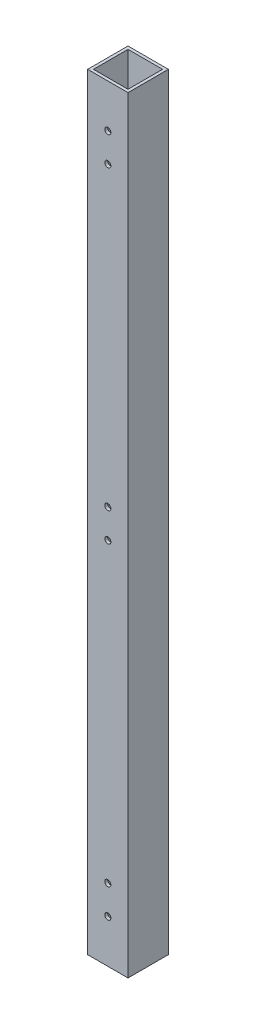
ISO-10303-21;
HEADER;
FILE_DESCRIPTION(('STEP AP214'),'2;1');
FILE_NAME('part.step','',(''),(''),'','','');
FILE_SCHEMA(('AUTOMOTIVE_DESIGN { 1 0 10303 214 1 1 1 1 }'));
ENDSEC;
DATA;
#1=APPLICATION_CONTEXT('core data for automotive mechanical design processes');
#2=APPLICATION_PROTOCOL_DEFINITION('international standard','automotive_design',2000,#1);
#3=PRODUCT_CONTEXT('',#1,'mechanical');
#4=PRODUCT('Part','Part','',(#3));
#5=PRODUCT_RELATED_PRODUCT_CATEGORY('part','',(#4));
#6=PRODUCT_DEFINITION_FORMATION('','',#4);
#7=PRODUCT_DEFINITION_CONTEXT('part definition',#1,'design');
#8=PRODUCT_DEFINITION('design','',#6,#7);
#9=PRODUCT_DEFINITION_SHAPE('','',#8);
#10=(LENGTH_UNIT() NAMED_UNIT(*) SI_UNIT(.MILLI.,.METRE.));
#11=(NAMED_UNIT(*) PLANE_ANGLE_UNIT() SI_UNIT($,.RADIAN.));
#12=(NAMED_UNIT(*) SI_UNIT($,.STERADIAN.) SOLID_ANGLE_UNIT());
#13=UNCERTAINTY_MEASURE_WITH_UNIT(LENGTH_MEASURE(1.E-05),#10,'distance_accuracy_value','');
#14=(GEOMETRIC_REPRESENTATION_CONTEXT(3) GLOBAL_UNCERTAINTY_ASSIGNED_CONTEXT((#13)) GLOBAL_UNIT_ASSIGNED_CONTEXT((#10,
#11,#12)) REPRESENTATION_CONTEXT('',''));
#15=CARTESIAN_POINT('',(0.,0.,0.));
#16=DIRECTION('',(0.,0.,1.));
#17=DIRECTION('',(1.,0.,0.));
#18=AXIS2_PLACEMENT_3D('',#15,#16,#17);
#19=CARTESIAN_POINT('',(0.,844.55,0.));
#20=DIRECTION('',(0.,-1.,0.));
#21=DIRECTION('',(0.,0.,-1.));
#22=AXIS2_PLACEMENT_3D('',#19,#20,#21);
#23=PLANE('',#22);
#24=DIRECTION('',(0.,0.,1.));
#25=VECTOR('',#24,1.);
#26=CARTESIAN_POINT('',(0.,844.55,0.));
#27=LINE('',#26,#25);
#28=CARTESIAN_POINT('',(0.,844.55,-44.45));
#29=VERTEX_POINT('',#28);
#30=CARTESIAN_POINT('',(0.,844.55,0.));
#31=VERTEX_POINT('',#30);
#32=EDGE_CURVE('E144',#29,#31,#27,.T.);
#33=ORIENTED_EDGE('',*,*,#32,.T.);
#34=DIRECTION('',(1.,0.,0.));
#35=VECTOR('',#34,1.);
#36=CARTESIAN_POINT('',(0.,844.55,0.));
#37=LINE('',#36,#35);
#38=CARTESIAN_POINT('',(44.45,844.55,0.));
#39=VERTEX_POINT('',#38);
#40=EDGE_CURVE('E147',#31,#39,#37,.T.);
#41=ORIENTED_EDGE('',*,*,#40,.T.);
#42=DIRECTION('',(0.,0.,-1.));
#43=VECTOR('',#42,1.);
#44=CARTESIAN_POINT('',(44.45,844.55,0.));
#45=LINE('',#44,#43);
#46=CARTESIAN_POINT('',(44.45,844.55,-44.45));
#47=VERTEX_POINT('',#46);
#48=EDGE_CURVE('E150',#39,#47,#45,.T.);
#49=ORIENTED_EDGE('',*,*,#48,.T.);
#50=DIRECTION('',(-1.,0.,0.));
#51=VECTOR('',#50,1.);
#52=CARTESIAN_POINT('',(0.,844.55,-44.45));
#53=LINE('',#52,#51);
#54=EDGE_CURVE('E152',#47,#29,#53,.T.);
#55=ORIENTED_EDGE('',*,*,#54,.T.);
#56=EDGE_LOOP('',(#33,#41,#49,#55));
#57=FACE_BOUND('',#56,.T.);
#58=DIRECTION('',(0.,0.,1.));
#59=VECTOR('',#58,1.);
#60=CARTESIAN_POINT('',(3.175,844.55,-41.275));
#61=LINE('',#60,#59);
#62=CARTESIAN_POINT('',(3.175,844.55,-41.275));
#63=VERTEX_POINT('',#62);
#64=CARTESIAN_POINT('',(3.17500000000001,844.55,-3.175));
#65=VERTEX_POINT('',#64);
#66=EDGE_CURVE('E106',#63,#65,#61,.T.);
#67=ORIENTED_EDGE('',*,*,#66,.F.);
#68=DIRECTION('',(-1.,0.,0.));
#69=VECTOR('',#68,1.);
#70=CARTESIAN_POINT('',(3.175,844.55,-41.275));
#71=LINE('',#70,#69);
#72=CARTESIAN_POINT('',(41.275,844.55,-41.275));
#73=VERTEX_POINT('',#72);
#74=EDGE_CURVE('E128',#73,#63,#71,.T.);
#75=ORIENTED_EDGE('',*,*,#74,.F.);
#76=DIRECTION('',(0.,0.,-1.));
#77=VECTOR('',#76,1.);
#78=CARTESIAN_POINT('',(41.275,844.55,-41.275));
#79=LINE('',#78,#77);
#80=CARTESIAN_POINT('',(41.275,844.55,-3.175));
#81=VERTEX_POINT('',#80);
#82=EDGE_CURVE('E126',#81,#73,#79,.T.);
#83=ORIENTED_EDGE('',*,*,#82,.F.);
#84=DIRECTION('',(1.,0.,0.));
#85=VECTOR('',#84,1.);
#86=CARTESIAN_POINT('',(3.17500000000001,844.55,-3.175));
#87=LINE('',#86,#85);
#88=EDGE_CURVE('E114',#65,#81,#87,.T.);
#89=ORIENTED_EDGE('',*,*,#88,.F.);
#90=EDGE_LOOP('',(#67,#75,#83,#89));
#91=FACE_BOUND('',#90,.T.);
#92=ADVANCED_FACE('F39',(#57,#91),#23,.F.);
#93=CARTESIAN_POINT('',(0.,0.,0.));
#94=DIRECTION('',(0.,-1.,0.));
#95=DIRECTION('',(0.,0.,-1.));
#96=AXIS2_PLACEMENT_3D('',#93,#94,#95);
#97=PLANE('',#96);
#98=DIRECTION('',(0.,0.,1.));
#99=VECTOR('',#98,1.);
#100=CARTESIAN_POINT('',(0.,0.,0.));
#101=LINE('',#100,#99);
#102=CARTESIAN_POINT('',(0.,0.,-44.45));
#103=VERTEX_POINT('',#102);
#104=CARTESIAN_POINT('',(0.,0.,0.));
#105=VERTEX_POINT('',#104);
#106=EDGE_CURVE('E122',#103,#105,#101,.T.);
#107=ORIENTED_EDGE('',*,*,#106,.F.);
#108=DIRECTION('',(-1.,0.,0.));
#109=VECTOR('',#108,1.);
#110=CARTESIAN_POINT('',(0.,0.,-44.45));
#111=LINE('',#110,#109);
#112=CARTESIAN_POINT('',(44.45,0.,-44.45));
#113=VERTEX_POINT('',#112);
#114=EDGE_CURVE('E148',#113,#103,#111,.T.);
#115=ORIENTED_EDGE('',*,*,#114,.F.);
#116=DIRECTION('',(0.,0.,-1.));
#117=VECTOR('',#116,1.);
#118=CARTESIAN_POINT('',(44.45,0.,0.));
#119=LINE('',#118,#117);
#120=CARTESIAN_POINT('',(44.45,0.,0.));
#121=VERTEX_POINT('',#120);
#122=EDGE_CURVE('E159',#121,#113,#119,.T.);
#123=ORIENTED_EDGE('',*,*,#122,.F.);
#124=DIRECTION('',(1.,0.,0.));
#125=VECTOR('',#124,1.);
#126=CARTESIAN_POINT('',(0.,0.,0.));
#127=LINE('',#126,#125);
#128=EDGE_CURVE('E157',#105,#121,#127,.T.);
#129=ORIENTED_EDGE('',*,*,#128,.F.);
#130=EDGE_LOOP('',(#107,#115,#123,#129));
#131=FACE_BOUND('',#130,.T.);
#132=DIRECTION('',(-1.,0.,0.));
#133=VECTOR('',#132,1.);
#134=CARTESIAN_POINT('',(3.175,0.,-41.275));
#135=LINE('',#134,#133);
#136=CARTESIAN_POINT('',(41.275,0.,-41.275));
#137=VERTEX_POINT('',#136);
#138=CARTESIAN_POINT('',(3.175,0.,-41.275));
#139=VERTEX_POINT('',#138);
#140=EDGE_CURVE('E115',#137,#139,#135,.T.);
#141=ORIENTED_EDGE('',*,*,#140,.T.);
#142=DIRECTION('',(0.,0.,1.));
#143=VECTOR('',#142,1.);
#144=CARTESIAN_POINT('',(3.175,0.,-41.275));
#145=LINE('',#144,#143);
#146=CARTESIAN_POINT('',(3.17500000000001,0.,-3.175));
#147=VERTEX_POINT('',#146);
#148=EDGE_CURVE('E64',#139,#147,#145,.T.);
#149=ORIENTED_EDGE('',*,*,#148,.T.);
#150=DIRECTION('',(1.,0.,0.));
#151=VECTOR('',#150,1.);
#152=CARTESIAN_POINT('',(3.17500000000001,0.,-3.175));
#153=LINE('',#152,#151);
#154=CARTESIAN_POINT('',(41.275,0.,-3.175));
#155=VERTEX_POINT('',#154);
#156=EDGE_CURVE('E121',#147,#155,#153,.T.);
#157=ORIENTED_EDGE('',*,*,#156,.T.);
#158=DIRECTION('',(0.,0.,-1.));
#159=VECTOR('',#158,1.);
#160=CARTESIAN_POINT('',(41.275,0.,-41.275));
#161=LINE('',#160,#159);
#162=EDGE_CURVE('E136',#155,#137,#161,.T.);
#163=ORIENTED_EDGE('',*,*,#162,.T.);
#164=EDGE_LOOP('',(#141,#149,#157,#163));
#165=FACE_BOUND('',#164,.T.);
#166=ADVANCED_FACE('F243',(#131,#165),#97,.T.);
#167=CARTESIAN_POINT('',(0.,844.55,0.));
#168=DIRECTION('',(1.,0.,0.));
#169=DIRECTION('',(0.,0.,-1.));
#170=AXIS2_PLACEMENT_3D('',#167,#168,#169);
#171=PLANE('',#170);
#172=ORIENTED_EDGE('',*,*,#106,.T.);
#173=DIRECTION('',(0.,-1.,0.));
#174=VECTOR('',#173,1.);
#175=CARTESIAN_POINT('',(0.,844.55,0.));
#176=LINE('',#175,#174);
#177=EDGE_CURVE('E11',#31,#105,#176,.T.);
#178=ORIENTED_EDGE('',*,*,#177,.F.);
#179=ORIENTED_EDGE('',*,*,#32,.F.);
#180=DIRECTION('',(0.,-1.,0.));
#181=VECTOR('',#180,1.);
#182=CARTESIAN_POINT('',(0.,844.55,-44.45));
#183=LINE('',#182,#181);
#184=EDGE_CURVE('E154',#29,#103,#183,.T.);
#185=ORIENTED_EDGE('',*,*,#184,.T.);
#186=EDGE_LOOP('',(#172,#178,#179,#185));
#187=FACE_BOUND('',#186,.T.);
#188=ADVANCED_FACE('F41',(#187),#171,.F.);
#189=CARTESIAN_POINT('',(0.,844.55,0.));
#190=DIRECTION('',(0.,0.,-1.));
#191=DIRECTION('',(-1.,0.,0.));
#192=AXIS2_PLACEMENT_3D('',#189,#190,#191);
#193=PLANE('',#192);
#194=CARTESIAN_POINT('',(22.225,796.925,0.));
#195=DIRECTION('',(0.,0.,1.));
#196=DIRECTION('',(1.,0.,0.));
#197=AXIS2_PLACEMENT_3D('',#194,#195,#196);
#198=CIRCLE('',#197,3.37350099999999);
#199=CARTESIAN_POINT('',(25.598501,796.925,0.));
#200=VERTEX_POINT('',#199);
#201=EDGE_CURVE('E280',#200,#200,#198,.T.);
#202=ORIENTED_EDGE('',*,*,#201,.F.);
#203=EDGE_LOOP('',(#202));
#204=FACE_BOUND('',#203,.T.);
#205=CARTESIAN_POINT('',(22.225,765.175,0.));
#206=DIRECTION('',(0.,0.,1.));
#207=DIRECTION('',(1.,0.,0.));
#208=AXIS2_PLACEMENT_3D('',#205,#206,#207);
#209=CIRCLE('',#208,3.37350099999999);
#210=CARTESIAN_POINT('',(25.598501,765.175,0.));
#211=VERTEX_POINT('',#210);
#212=EDGE_CURVE('E193',#211,#211,#209,.T.);
#213=ORIENTED_EDGE('',*,*,#212,.F.);
#214=EDGE_LOOP('',(#213));
#215=FACE_BOUND('',#214,.T.);
#216=CARTESIAN_POINT('',(22.225,438.15,0.));
#217=DIRECTION('',(0.,0.,1.));
#218=DIRECTION('',(1.,0.,0.));
#219=AXIS2_PLACEMENT_3D('',#216,#217,#218);
#220=CIRCLE('',#219,3.37350099999999);
#221=CARTESIAN_POINT('',(25.598501,438.15,0.));
#222=VERTEX_POINT('',#221);
#223=EDGE_CURVE('E190',#222,#222,#220,.T.);
#224=ORIENTED_EDGE('',*,*,#223,.F.);
#225=EDGE_LOOP('',(#224));
#226=FACE_BOUND('',#225,.T.);
#227=CARTESIAN_POINT('',(22.225,406.4,0.));
#228=DIRECTION('',(0.,0.,1.));
#229=DIRECTION('',(1.,0.,0.));
#230=AXIS2_PLACEMENT_3D('',#227,#228,#229);
#231=CIRCLE('',#230,3.37350099999999);
#232=CARTESIAN_POINT('',(25.598501,406.4,0.));
#233=VERTEX_POINT('',#232);
#234=EDGE_CURVE('E208',#233,#233,#231,.T.);
#235=ORIENTED_EDGE('',*,*,#234,.F.);
#236=EDGE_LOOP('',(#235));
#237=FACE_BOUND('',#236,.T.);
#238=CARTESIAN_POINT('',(22.225,79.3750000000001,0.));
#239=DIRECTION('',(0.,0.,1.));
#240=DIRECTION('',(1.,0.,0.));
#241=AXIS2_PLACEMENT_3D('',#238,#239,#240);
#242=CIRCLE('',#241,3.37350099999999);
#243=CARTESIAN_POINT('',(25.598501,79.3750000000001,0.));
#244=VERTEX_POINT('',#243);
#245=EDGE_CURVE('E215',#244,#244,#242,.T.);
#246=ORIENTED_EDGE('',*,*,#245,.F.);
#247=EDGE_LOOP('',(#246));
#248=FACE_BOUND('',#247,.T.);
#249=CARTESIAN_POINT('',(22.225,47.625,0.));
#250=DIRECTION('',(0.,0.,1.));
#251=DIRECTION('',(1.,0.,0.));
#252=AXIS2_PLACEMENT_3D('',#249,#250,#251);
#253=CIRCLE('',#252,3.37350099999999);
#254=CARTESIAN_POINT('',(25.598501,47.625,0.));
#255=VERTEX_POINT('',#254);
#256=EDGE_CURVE('E222',#255,#255,#253,.T.);
#257=ORIENTED_EDGE('',*,*,#256,.F.);
#258=EDGE_LOOP('',(#257));
#259=FACE_BOUND('',#258,.T.);
#260=ORIENTED_EDGE('',*,*,#128,.T.);
#261=DIRECTION('',(0.,-1.,0.));
#262=VECTOR('',#261,1.);
#263=CARTESIAN_POINT('',(44.45,844.55,0.));
#264=LINE('',#263,#262);
#265=EDGE_CURVE('E48',#39,#121,#264,.T.);
#266=ORIENTED_EDGE('',*,*,#265,.F.);
#267=ORIENTED_EDGE('',*,*,#40,.F.);
#268=ORIENTED_EDGE('',*,*,#177,.T.);
#269=EDGE_LOOP('',(#260,#266,#267,#268));
#270=FACE_BOUND('',#269,.T.);
#271=ADVANCED_FACE('F270',(#204,#215,#226,#237,#248,#259,#270),#193,.F.);
#272=CARTESIAN_POINT('',(44.45,844.55,0.));
#273=DIRECTION('',(-1.,0.,0.));
#274=DIRECTION('',(0.,0.,1.));
#275=AXIS2_PLACEMENT_3D('',#272,#273,#274);
#276=PLANE('',#275);
#277=ORIENTED_EDGE('',*,*,#122,.T.);
#278=DIRECTION('',(0.,-1.,0.));
#279=VECTOR('',#278,1.);
#280=CARTESIAN_POINT('',(44.45,844.55,-44.45));
#281=LINE('',#280,#279);
#282=EDGE_CURVE('E164',#47,#113,#281,.T.);
#283=ORIENTED_EDGE('',*,*,#282,.F.);
#284=ORIENTED_EDGE('',*,*,#48,.F.);
#285=ORIENTED_EDGE('',*,*,#265,.T.);
#286=EDGE_LOOP('',(#277,#283,#284,#285));
#287=FACE_BOUND('',#286,.T.);
#288=ADVANCED_FACE('F267',(#287),#276,.F.);
#289=CARTESIAN_POINT('',(0.,844.55,-44.45));
#290=DIRECTION('',(0.,0.,1.));
#291=DIRECTION('',(1.,0.,0.));
#292=AXIS2_PLACEMENT_3D('',#289,#290,#291);
#293=PLANE('',#292);
#294=CARTESIAN_POINT('',(22.225,796.925,-44.45));
#295=DIRECTION('',(0.,0.,1.));
#296=DIRECTION('',(1.,0.,0.));
#297=AXIS2_PLACEMENT_3D('',#294,#295,#296);
#298=CIRCLE('',#297,3.37350099999999);
#299=CARTESIAN_POINT('',(25.598501,796.925,-44.45));
#300=VERTEX_POINT('',#299);
#301=EDGE_CURVE('E345',#300,#300,#298,.T.);
#302=ORIENTED_EDGE('',*,*,#301,.T.);
#303=EDGE_LOOP('',(#302));
#304=FACE_BOUND('',#303,.T.);
#305=CARTESIAN_POINT('',(22.225,765.175,-44.45));
#306=DIRECTION('',(0.,0.,1.));
#307=DIRECTION('',(1.,0.,0.));
#308=AXIS2_PLACEMENT_3D('',#305,#306,#307);
#309=CIRCLE('',#308,3.37350099999999);
#310=CARTESIAN_POINT('',(25.598501,765.175,-44.45));
#311=VERTEX_POINT('',#310);
#312=EDGE_CURVE('E186',#311,#311,#309,.T.);
#313=ORIENTED_EDGE('',*,*,#312,.T.);
#314=EDGE_LOOP('',(#313));
#315=FACE_BOUND('',#314,.T.);
#316=CARTESIAN_POINT('',(22.225,438.15,-44.45));
#317=DIRECTION('',(0.,0.,1.));
#318=DIRECTION('',(1.,0.,0.));
#319=AXIS2_PLACEMENT_3D('',#316,#317,#318);
#320=CIRCLE('',#319,3.37350099999999);
#321=CARTESIAN_POINT('',(25.598501,438.15,-44.45));
#322=VERTEX_POINT('',#321);
#323=EDGE_CURVE('E182',#322,#322,#320,.T.);
#324=ORIENTED_EDGE('',*,*,#323,.T.);
#325=EDGE_LOOP('',(#324));
#326=FACE_BOUND('',#325,.T.);
#327=CARTESIAN_POINT('',(22.225,406.4,-44.45));
#328=DIRECTION('',(0.,0.,1.));
#329=DIRECTION('',(1.,0.,0.));
#330=AXIS2_PLACEMENT_3D('',#327,#328,#329);
#331=CIRCLE('',#330,3.37350099999999);
#332=CARTESIAN_POINT('',(25.598501,406.4,-44.45));
#333=VERTEX_POINT('',#332);
#334=EDGE_CURVE('E178',#333,#333,#331,.T.);
#335=ORIENTED_EDGE('',*,*,#334,.T.);
#336=EDGE_LOOP('',(#335));
#337=FACE_BOUND('',#336,.T.);
#338=CARTESIAN_POINT('',(22.225,79.3750000000001,-44.45));
#339=DIRECTION('',(0.,0.,1.));
#340=DIRECTION('',(1.,0.,0.));
#341=AXIS2_PLACEMENT_3D('',#338,#339,#340);
#342=CIRCLE('',#341,3.37350099999999);
#343=CARTESIAN_POINT('',(25.598501,79.3750000000001,-44.45));
#344=VERTEX_POINT('',#343);
#345=EDGE_CURVE('E173',#344,#344,#342,.T.);
#346=ORIENTED_EDGE('',*,*,#345,.T.);
#347=EDGE_LOOP('',(#346));
#348=FACE_BOUND('',#347,.T.);
#349=CARTESIAN_POINT('',(22.225,47.625,-44.45));
#350=DIRECTION('',(0.,0.,1.));
#351=DIRECTION('',(1.,0.,0.));
#352=AXIS2_PLACEMENT_3D('',#349,#350,#351);
#353=CIRCLE('',#352,3.37350099999999);
#354=CARTESIAN_POINT('',(25.598501,47.625,-44.45));
#355=VERTEX_POINT('',#354);
#356=EDGE_CURVE('E225',#355,#355,#353,.T.);
#357=ORIENTED_EDGE('',*,*,#356,.T.);
#358=EDGE_LOOP('',(#357));
#359=FACE_BOUND('',#358,.T.);
#360=ORIENTED_EDGE('',*,*,#114,.T.);
#361=ORIENTED_EDGE('',*,*,#184,.F.);
#362=ORIENTED_EDGE('',*,*,#54,.F.);
#363=ORIENTED_EDGE('',*,*,#282,.T.);
#364=EDGE_LOOP('',(#360,#361,#362,#363));
#365=FACE_BOUND('',#364,.T.);
#366=ADVANCED_FACE('F264',(#304,#315,#326,#337,#348,#359,#365),#293,.F.);
#367=CARTESIAN_POINT('',(3.175,844.55,-41.275));
#368=DIRECTION('',(1.,0.,0.));
#369=DIRECTION('',(0.,0.,-1.));
#370=AXIS2_PLACEMENT_3D('',#367,#368,#369);
#371=PLANE('',#370);
#372=ORIENTED_EDGE('',*,*,#148,.F.);
#373=DIRECTION('',(0.,-1.,0.));
#374=VECTOR('',#373,1.);
#375=CARTESIAN_POINT('',(3.175,844.55,-41.275));
#376=LINE('',#375,#374);
#377=EDGE_CURVE('E110',#63,#139,#376,.T.);
#378=ORIENTED_EDGE('',*,*,#377,.F.);
#379=ORIENTED_EDGE('',*,*,#66,.T.);
#380=DIRECTION('',(0.,-1.,0.));
#381=VECTOR('',#380,1.);
#382=CARTESIAN_POINT('',(3.17500000000001,844.55,-3.175));
#383=LINE('',#382,#381);
#384=EDGE_CURVE('E109',#65,#147,#383,.T.);
#385=ORIENTED_EDGE('',*,*,#384,.T.);
#386=EDGE_LOOP('',(#372,#378,#379,#385));
#387=FACE_BOUND('',#386,.T.);
#388=ADVANCED_FACE('F108',(#387),#371,.T.);
#389=CARTESIAN_POINT('',(3.17500000000001,844.55,-3.175));
#390=DIRECTION('',(0.,0.,-1.));
#391=DIRECTION('',(-1.,0.,0.));
#392=AXIS2_PLACEMENT_3D('',#389,#390,#391);
#393=PLANE('',#392);
#394=CARTESIAN_POINT('',(22.225,796.925,-3.175));
#395=DIRECTION('',(0.,0.,-1.));
#396=DIRECTION('',(-1.,0.,0.));
#397=AXIS2_PLACEMENT_3D('',#394,#395,#396);
#398=CIRCLE('',#397,3.37350099999999);
#399=CARTESIAN_POINT('',(18.851499,796.925,-3.175));
#400=VERTEX_POINT('',#399);
#401=EDGE_CURVE('E198',#400,#400,#398,.T.);
#402=ORIENTED_EDGE('',*,*,#401,.F.);
#403=EDGE_LOOP('',(#402));
#404=FACE_BOUND('',#403,.T.);
#405=CARTESIAN_POINT('',(22.225,765.175,-3.175));
#406=DIRECTION('',(0.,0.,-1.));
#407=DIRECTION('',(-1.,0.,0.));
#408=AXIS2_PLACEMENT_3D('',#405,#406,#407);
#409=CIRCLE('',#408,3.37350099999999);
#410=CARTESIAN_POINT('',(18.851499,765.175,-3.175));
#411=VERTEX_POINT('',#410);
#412=EDGE_CURVE('E185',#411,#411,#409,.T.);
#413=ORIENTED_EDGE('',*,*,#412,.F.);
#414=EDGE_LOOP('',(#413));
#415=FACE_BOUND('',#414,.T.);
#416=CARTESIAN_POINT('',(22.225,438.15,-3.175));
#417=DIRECTION('',(0.,0.,-1.));
#418=DIRECTION('',(-1.,0.,0.));
#419=AXIS2_PLACEMENT_3D('',#416,#417,#418);
#420=CIRCLE('',#419,3.37350099999999);
#421=CARTESIAN_POINT('',(18.851499,438.15,-3.175));
#422=VERTEX_POINT('',#421);
#423=EDGE_CURVE('E179',#422,#422,#420,.T.);
#424=ORIENTED_EDGE('',*,*,#423,.F.);
#425=EDGE_LOOP('',(#424));
#426=FACE_BOUND('',#425,.T.);
#427=CARTESIAN_POINT('',(22.225,406.4,-3.175));
#428=DIRECTION('',(0.,0.,-1.));
#429=DIRECTION('',(-1.,0.,0.));
#430=AXIS2_PLACEMENT_3D('',#427,#428,#429);
#431=CIRCLE('',#430,3.37350099999999);
#432=CARTESIAN_POINT('',(18.851499,406.4,-3.175));
#433=VERTEX_POINT('',#432);
#434=EDGE_CURVE('E174',#433,#433,#431,.T.);
#435=ORIENTED_EDGE('',*,*,#434,.F.);
#436=EDGE_LOOP('',(#435));
#437=FACE_BOUND('',#436,.T.);
#438=CARTESIAN_POINT('',(22.225,79.3750000000001,-3.175));
#439=DIRECTION('',(0.,0.,-1.));
#440=DIRECTION('',(-1.,0.,0.));
#441=AXIS2_PLACEMENT_3D('',#438,#439,#440);
#442=CIRCLE('',#441,3.37350099999999);
#443=CARTESIAN_POINT('',(18.851499,79.3750000000001,-3.175));
#444=VERTEX_POINT('',#443);
#445=EDGE_CURVE('E169',#444,#444,#442,.T.);
#446=ORIENTED_EDGE('',*,*,#445,.F.);
#447=EDGE_LOOP('',(#446));
#448=FACE_BOUND('',#447,.T.);
#449=CARTESIAN_POINT('',(22.225,47.625,-3.175));
#450=DIRECTION('',(0.,0.,-1.));
#451=DIRECTION('',(-1.,0.,0.));
#452=AXIS2_PLACEMENT_3D('',#449,#450,#451);
#453=CIRCLE('',#452,3.37350099999999);
#454=CARTESIAN_POINT('',(18.851499,47.625,-3.175));
#455=VERTEX_POINT('',#454);
#456=EDGE_CURVE('E228',#455,#455,#453,.T.);
#457=ORIENTED_EDGE('',*,*,#456,.F.);
#458=EDGE_LOOP('',(#457));
#459=FACE_BOUND('',#458,.T.);
#460=ORIENTED_EDGE('',*,*,#156,.F.);
#461=ORIENTED_EDGE('',*,*,#384,.F.);
#462=ORIENTED_EDGE('',*,*,#88,.T.);
#463=DIRECTION('',(0.,-1.,0.));
#464=VECTOR('',#463,1.);
#465=CARTESIAN_POINT('',(41.275,844.55,-3.175));
#466=LINE('',#465,#464);
#467=EDGE_CURVE('E123',#81,#155,#466,.T.);
#468=ORIENTED_EDGE('',*,*,#467,.T.);
#469=EDGE_LOOP('',(#460,#461,#462,#468));
#470=FACE_BOUND('',#469,.T.);
#471=ADVANCED_FACE('F118',(#404,#415,#426,#437,#448,#459,#470),#393,.T.);
#472=CARTESIAN_POINT('',(41.275,844.55,-41.275));
#473=DIRECTION('',(-1.,0.,0.));
#474=DIRECTION('',(0.,0.,1.));
#475=AXIS2_PLACEMENT_3D('',#472,#473,#474);
#476=PLANE('',#475);
#477=ORIENTED_EDGE('',*,*,#162,.F.);
#478=ORIENTED_EDGE('',*,*,#467,.F.);
#479=ORIENTED_EDGE('',*,*,#82,.T.);
#480=DIRECTION('',(0.,-1.,0.));
#481=VECTOR('',#480,1.);
#482=CARTESIAN_POINT('',(41.275,844.55,-41.275));
#483=LINE('',#482,#481);
#484=EDGE_CURVE('E56',#73,#137,#483,.T.);
#485=ORIENTED_EDGE('',*,*,#484,.T.);
#486=EDGE_LOOP('',(#477,#478,#479,#485));
#487=FACE_BOUND('',#486,.T.);
#488=ADVANCED_FACE('F238',(#487),#476,.T.);
#489=CARTESIAN_POINT('',(3.175,844.55,-41.275));
#490=DIRECTION('',(0.,0.,1.));
#491=DIRECTION('',(1.,0.,0.));
#492=AXIS2_PLACEMENT_3D('',#489,#490,#491);
#493=PLANE('',#492);
#494=CARTESIAN_POINT('',(22.225,796.925,-41.275));
#495=DIRECTION('',(0.,0.,1.));
#496=DIRECTION('',(1.,0.,0.));
#497=AXIS2_PLACEMENT_3D('',#494,#495,#496);
#498=CIRCLE('',#497,3.37350099999999);
#499=CARTESIAN_POINT('',(25.598501,796.925,-41.275));
#500=VERTEX_POINT('',#499);
#501=EDGE_CURVE('E43',#500,#500,#498,.T.);
#502=ORIENTED_EDGE('',*,*,#501,.F.);
#503=EDGE_LOOP('',(#502));
#504=FACE_BOUND('',#503,.T.);
#505=CARTESIAN_POINT('',(22.225,765.175,-41.275));
#506=DIRECTION('',(0.,0.,1.));
#507=DIRECTION('',(1.,0.,0.));
#508=AXIS2_PLACEMENT_3D('',#505,#506,#507);
#509=CIRCLE('',#508,3.37350099999999);
#510=CARTESIAN_POINT('',(25.598501,765.175,-41.275));
#511=VERTEX_POINT('',#510);
#512=EDGE_CURVE('E183',#511,#511,#509,.T.);
#513=ORIENTED_EDGE('',*,*,#512,.F.);
#514=EDGE_LOOP('',(#513));
#515=FACE_BOUND('',#514,.T.);
#516=CARTESIAN_POINT('',(22.225,438.15,-41.275));
#517=DIRECTION('',(0.,0.,1.));
#518=DIRECTION('',(1.,0.,0.));
#519=AXIS2_PLACEMENT_3D('',#516,#517,#518);
#520=CIRCLE('',#519,3.37350099999999);
#521=CARTESIAN_POINT('',(25.598501,438.15,-41.275));
#522=VERTEX_POINT('',#521);
#523=EDGE_CURVE('E181',#522,#522,#520,.T.);
#524=ORIENTED_EDGE('',*,*,#523,.F.);
#525=EDGE_LOOP('',(#524));
#526=FACE_BOUND('',#525,.T.);
#527=CARTESIAN_POINT('',(22.225,406.4,-41.275));
#528=DIRECTION('',(0.,0.,1.));
#529=DIRECTION('',(1.,0.,0.));
#530=AXIS2_PLACEMENT_3D('',#527,#528,#529);
#531=CIRCLE('',#530,3.37350099999999);
#532=CARTESIAN_POINT('',(25.598501,406.4,-41.275));
#533=VERTEX_POINT('',#532);
#534=EDGE_CURVE('E177',#533,#533,#531,.T.);
#535=ORIENTED_EDGE('',*,*,#534,.F.);
#536=EDGE_LOOP('',(#535));
#537=FACE_BOUND('',#536,.T.);
#538=CARTESIAN_POINT('',(22.225,79.3750000000001,-41.275));
#539=DIRECTION('',(0.,0.,1.));
#540=DIRECTION('',(1.,0.,0.));
#541=AXIS2_PLACEMENT_3D('',#538,#539,#540);
#542=CIRCLE('',#541,3.37350099999999);
#543=CARTESIAN_POINT('',(25.598501,79.3750000000001,-41.275));
#544=VERTEX_POINT('',#543);
#545=EDGE_CURVE('E172',#544,#544,#542,.T.);
#546=ORIENTED_EDGE('',*,*,#545,.F.);
#547=EDGE_LOOP('',(#546));
#548=FACE_BOUND('',#547,.T.);
#549=CARTESIAN_POINT('',(22.225,47.625,-41.275));
#550=DIRECTION('',(0.,0.,1.));
#551=DIRECTION('',(1.,0.,0.));
#552=AXIS2_PLACEMENT_3D('',#549,#550,#551);
#553=CIRCLE('',#552,3.37350099999999);
#554=CARTESIAN_POINT('',(25.598501,47.625,-41.275));
#555=VERTEX_POINT('',#554);
#556=EDGE_CURVE('E134',#555,#555,#553,.T.);
#557=ORIENTED_EDGE('',*,*,#556,.F.);
#558=EDGE_LOOP('',(#557));
#559=FACE_BOUND('',#558,.T.);
#560=ORIENTED_EDGE('',*,*,#140,.F.);
#561=ORIENTED_EDGE('',*,*,#484,.F.);
#562=ORIENTED_EDGE('',*,*,#74,.T.);
#563=ORIENTED_EDGE('',*,*,#377,.T.);
#564=EDGE_LOOP('',(#560,#561,#562,#563));
#565=FACE_BOUND('',#564,.T.);
#566=ADVANCED_FACE('F236',(#504,#515,#526,#537,#548,#559,#565),#493,.T.);
#567=CARTESIAN_POINT('',(22.225,47.625,0.));
#568=DIRECTION('',(0.,0.,1.));
#569=DIRECTION('',(1.,0.,0.));
#570=AXIS2_PLACEMENT_3D('',#567,#568,#569);
#571=CYLINDRICAL_SURFACE('',#570,3.37350099999999);
#572=ORIENTED_EDGE('',*,*,#556,.T.);
#573=EDGE_LOOP('',(#572));
#574=FACE_BOUND('',#573,.T.);
#575=ORIENTED_EDGE('',*,*,#356,.F.);
#576=EDGE_LOOP('',(#575));
#577=FACE_BOUND('',#576,.T.);
#578=ADVANCED_FACE('F233',(#574,#577),#571,.F.);
#579=ORIENTED_EDGE('',*,*,#456,.T.);
#580=EDGE_LOOP('',(#579));
#581=FACE_BOUND('',#580,.T.);
#582=ORIENTED_EDGE('',*,*,#256,.T.);
#583=EDGE_LOOP('',(#582));
#584=FACE_BOUND('',#583,.T.);
#585=ADVANCED_FACE('F303',(#581,#584),#571,.F.);
#586=CARTESIAN_POINT('',(22.225,79.3750000000001,0.));
#587=DIRECTION('',(0.,0.,1.));
#588=DIRECTION('',(1.,0.,0.));
#589=AXIS2_PLACEMENT_3D('',#586,#587,#588);
#590=CYLINDRICAL_SURFACE('',#589,3.37350099999999);
#591=ORIENTED_EDGE('',*,*,#445,.T.);
#592=EDGE_LOOP('',(#591));
#593=FACE_BOUND('',#592,.T.);
#594=ORIENTED_EDGE('',*,*,#245,.T.);
#595=EDGE_LOOP('',(#594));
#596=FACE_BOUND('',#595,.T.);
#597=ADVANCED_FACE('F305',(#593,#596),#590,.F.);
#598=ORIENTED_EDGE('',*,*,#545,.T.);
#599=EDGE_LOOP('',(#598));
#600=FACE_BOUND('',#599,.T.);
#601=ORIENTED_EDGE('',*,*,#345,.F.);
#602=EDGE_LOOP('',(#601));
#603=FACE_BOUND('',#602,.T.);
#604=ADVANCED_FACE('F312',(#600,#603),#590,.F.);
#605=CARTESIAN_POINT('',(22.225,406.4,0.));
#606=DIRECTION('',(0.,0.,1.));
#607=DIRECTION('',(1.,0.,0.));
#608=AXIS2_PLACEMENT_3D('',#605,#606,#607);
#609=CYLINDRICAL_SURFACE('',#608,3.37350099999999);
#610=ORIENTED_EDGE('',*,*,#434,.T.);
#611=EDGE_LOOP('',(#610));
#612=FACE_BOUND('',#611,.T.);
#613=ORIENTED_EDGE('',*,*,#234,.T.);
#614=EDGE_LOOP('',(#613));
#615=FACE_BOUND('',#614,.T.);
#616=ADVANCED_FACE('F316',(#612,#615),#609,.F.);
#617=ORIENTED_EDGE('',*,*,#534,.T.);
#618=EDGE_LOOP('',(#617));
#619=FACE_BOUND('',#618,.T.);
#620=ORIENTED_EDGE('',*,*,#334,.F.);
#621=EDGE_LOOP('',(#620));
#622=FACE_BOUND('',#621,.T.);
#623=ADVANCED_FACE('F319',(#619,#622),#609,.F.);
#624=CARTESIAN_POINT('',(22.225,438.15,0.));
#625=DIRECTION('',(0.,0.,1.));
#626=DIRECTION('',(1.,0.,0.));
#627=AXIS2_PLACEMENT_3D('',#624,#625,#626);
#628=CYLINDRICAL_SURFACE('',#627,3.37350099999999);
#629=ORIENTED_EDGE('',*,*,#423,.T.);
#630=EDGE_LOOP('',(#629));
#631=FACE_BOUND('',#630,.T.);
#632=ORIENTED_EDGE('',*,*,#223,.T.);
#633=EDGE_LOOP('',(#632));
#634=FACE_BOUND('',#633,.T.);
#635=ADVANCED_FACE('F321',(#631,#634),#628,.F.);
#636=ORIENTED_EDGE('',*,*,#523,.T.);
#637=EDGE_LOOP('',(#636));
#638=FACE_BOUND('',#637,.T.);
#639=ORIENTED_EDGE('',*,*,#323,.F.);
#640=EDGE_LOOP('',(#639));
#641=FACE_BOUND('',#640,.T.);
#642=ADVANCED_FACE('F324',(#638,#641),#628,.F.);
#643=CARTESIAN_POINT('',(22.225,765.175,0.));
#644=DIRECTION('',(0.,0.,1.));
#645=DIRECTION('',(1.,0.,0.));
#646=AXIS2_PLACEMENT_3D('',#643,#644,#645);
#647=CYLINDRICAL_SURFACE('',#646,3.37350099999999);
#648=ORIENTED_EDGE('',*,*,#512,.T.);
#649=EDGE_LOOP('',(#648));
#650=FACE_BOUND('',#649,.T.);
#651=ORIENTED_EDGE('',*,*,#312,.F.);
#652=EDGE_LOOP('',(#651));
#653=FACE_BOUND('',#652,.T.);
#654=ADVANCED_FACE('F326',(#650,#653),#647,.F.);
#655=ORIENTED_EDGE('',*,*,#412,.T.);
#656=EDGE_LOOP('',(#655));
#657=FACE_BOUND('',#656,.T.);
#658=ORIENTED_EDGE('',*,*,#212,.T.);
#659=EDGE_LOOP('',(#658));
#660=FACE_BOUND('',#659,.T.);
#661=ADVANCED_FACE('F329',(#657,#660),#647,.F.);
#662=CARTESIAN_POINT('',(22.225,796.925,0.));
#663=DIRECTION('',(0.,0.,1.));
#664=DIRECTION('',(1.,0.,0.));
#665=AXIS2_PLACEMENT_3D('',#662,#663,#664);
#666=CYLINDRICAL_SURFACE('',#665,3.37350099999999);
#667=ORIENTED_EDGE('',*,*,#501,.T.);
#668=EDGE_LOOP('',(#667));
#669=FACE_BOUND('',#668,.T.);
#670=ORIENTED_EDGE('',*,*,#301,.F.);
#671=EDGE_LOOP('',(#670));
#672=FACE_BOUND('',#671,.T.);
#673=ADVANCED_FACE('F330',(#669,#672),#666,.F.);
#674=ORIENTED_EDGE('',*,*,#401,.T.);
#675=EDGE_LOOP('',(#674));
#676=FACE_BOUND('',#675,.T.);
#677=ORIENTED_EDGE('',*,*,#201,.T.);
#678=EDGE_LOOP('',(#677));
#679=FACE_BOUND('',#678,.T.);
#680=ADVANCED_FACE('F332',(#676,#679),#666,.F.);
#681=CLOSED_SHELL('',(#92,#166,#188,#271,#288,#366,#388,#471,#488,#566,#578,#585,#597,#604,#616,
#623,#635,#642,#654,#661,#673,#680));
#682=MANIFOLD_SOLID_BREP('B2',#681);
#683=ADVANCED_BREP_SHAPE_REPRESENTATION('',(#18,#682),#14);
#684=SHAPE_DEFINITION_REPRESENTATION(#9,#683);
ENDSEC;
END-ISO-10303-21;
